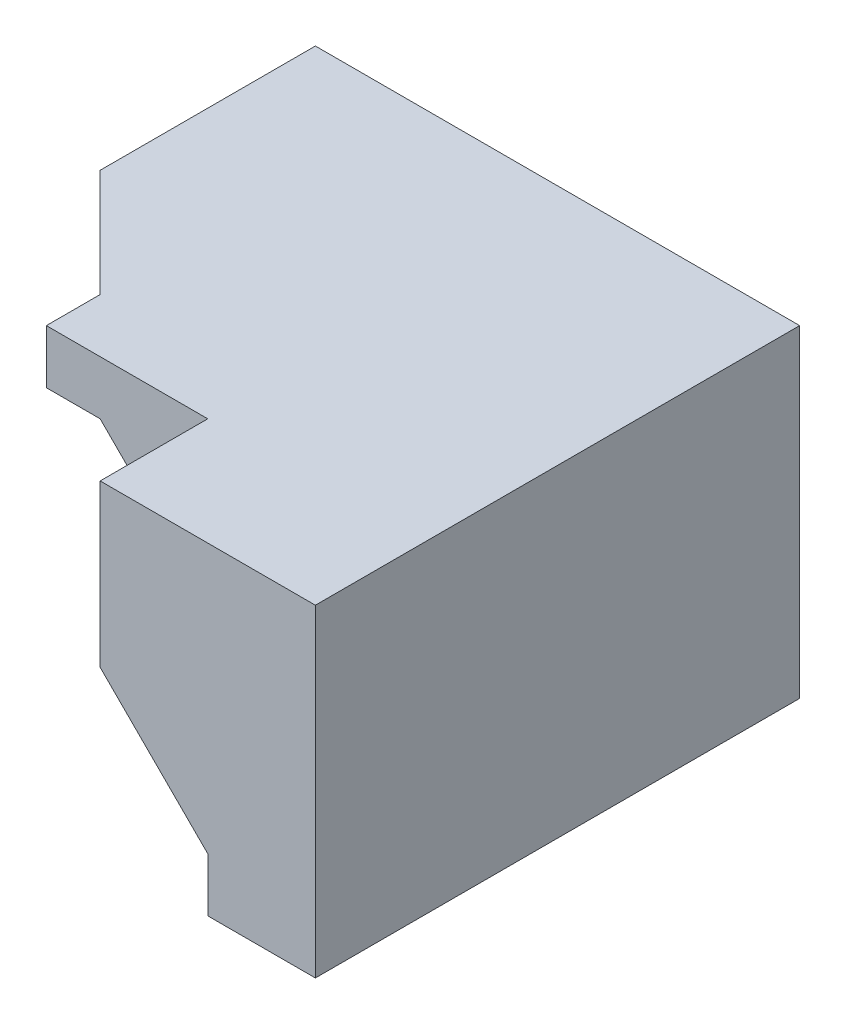
ISO-10303-21;
HEADER;
FILE_DESCRIPTION(('STEP AP214'),'2;1');
FILE_NAME('part.step','',(''),(''),'','','');
FILE_SCHEMA(('AUTOMOTIVE_DESIGN { 1 0 10303 214 1 1 1 1 }'));
ENDSEC;
DATA;
#1=APPLICATION_CONTEXT('core data for automotive mechanical design processes');
#2=APPLICATION_PROTOCOL_DEFINITION('international standard','automotive_design',2000,#1);
#3=PRODUCT_CONTEXT('',#1,'mechanical');
#4=PRODUCT('Part','Part','',(#3));
#5=PRODUCT_RELATED_PRODUCT_CATEGORY('part','',(#4));
#6=PRODUCT_DEFINITION_FORMATION('','',#4);
#7=PRODUCT_DEFINITION_CONTEXT('part definition',#1,'design');
#8=PRODUCT_DEFINITION('design','',#6,#7);
#9=PRODUCT_DEFINITION_SHAPE('','',#8);
#10=(LENGTH_UNIT() NAMED_UNIT(*) SI_UNIT(.MILLI.,.METRE.));
#11=(NAMED_UNIT(*) PLANE_ANGLE_UNIT() SI_UNIT($,.RADIAN.));
#12=(NAMED_UNIT(*) SI_UNIT($,.STERADIAN.) SOLID_ANGLE_UNIT());
#13=UNCERTAINTY_MEASURE_WITH_UNIT(LENGTH_MEASURE(1.E-05),#10,'distance_accuracy_value','');
#14=(GEOMETRIC_REPRESENTATION_CONTEXT(3) GLOBAL_UNCERTAINTY_ASSIGNED_CONTEXT((#13)) GLOBAL_UNIT_ASSIGNED_CONTEXT((#10,
#11,#12)) REPRESENTATION_CONTEXT('',''));
#15=CARTESIAN_POINT('',(0.,0.,0.));
#16=DIRECTION('',(0.,0.,1.));
#17=DIRECTION('',(1.,0.,0.));
#18=AXIS2_PLACEMENT_3D('',#15,#16,#17);
#19=CARTESIAN_POINT('',(20.,-20.,90.));
#20=DIRECTION('',(0.707106781186547,0.707106781186547,0.));
#21=DIRECTION('',(-0.707106781186548,0.707106781186547,0.));
#22=AXIS2_PLACEMENT_3D('',#19,#20,#21);
#23=PLANE('',#22);
#24=DIRECTION('',(0.,0.,1.));
#25=VECTOR('',#24,1.);
#26=CARTESIAN_POINT('',(-20.,20.,0.));
#27=LINE('',#26,#25);
#28=CARTESIAN_POINT('',(-20.,20.,40.));
#29=VERTEX_POINT('',#28);
#30=CARTESIAN_POINT('',(-20.,20.,70.));
#31=VERTEX_POINT('',#30);
#32=EDGE_CURVE('E252',#29,#31,#27,.T.);
#33=ORIENTED_EDGE('',*,*,#32,.F.);
#34=DIRECTION('',(0.707106781186548,-0.707106781186548,0.));
#35=VECTOR('',#34,1.);
#36=CARTESIAN_POINT('',(0.,0.,40.));
#37=LINE('',#36,#35);
#38=CARTESIAN_POINT('',(10.,-9.99999999999999,40.));
#39=VERTEX_POINT('',#38);
#40=EDGE_CURVE('E51',#29,#39,#37,.T.);
#41=ORIENTED_EDGE('',*,*,#40,.T.);
#42=DIRECTION('',(0.408248290463863,-0.408248290463863,0.816496580927726));
#43=VECTOR('',#42,1.);
#44=CARTESIAN_POINT('',(30.,-30.,80.));
#45=LINE('',#44,#43);
#46=CARTESIAN_POINT('',(20.,-20.,60.));
#47=VERTEX_POINT('',#46);
#48=EDGE_CURVE('E55',#39,#47,#45,.T.);
#49=ORIENTED_EDGE('',*,*,#48,.T.);
#50=DIRECTION('',(0.,0.,-1.));
#51=VECTOR('',#50,1.);
#52=CARTESIAN_POINT('',(20.,-20.,90.));
#53=LINE('',#52,#51);
#54=CARTESIAN_POINT('',(20.,-20.,90.));
#55=VERTEX_POINT('',#54);
#56=EDGE_CURVE('E11',#55,#47,#53,.T.);
#57=ORIENTED_EDGE('',*,*,#56,.F.);
#58=DIRECTION('',(0.707106781186548,-0.707106781186548,0.));
#59=VECTOR('',#58,1.);
#60=CARTESIAN_POINT('',(20.,-20.,90.));
#61=LINE('',#60,#59);
#62=CARTESIAN_POINT('',(0.,0.,90.));
#63=VERTEX_POINT('',#62);
#64=EDGE_CURVE('E261',#63,#55,#61,.T.);
#65=ORIENTED_EDGE('',*,*,#64,.F.);
#66=DIRECTION('',(0.,0.,-1.));
#67=VECTOR('',#66,1.);
#68=CARTESIAN_POINT('',(0.,0.,90.));
#69=LINE('',#68,#67);
#70=CARTESIAN_POINT('',(0.,0.,70.));
#71=VERTEX_POINT('',#70);
#72=EDGE_CURVE('E275',#63,#71,#69,.T.);
#73=ORIENTED_EDGE('',*,*,#72,.T.);
#74=DIRECTION('',(0.707106781186548,-0.707106781186547,0.));
#75=VECTOR('',#74,1.);
#76=CARTESIAN_POINT('',(-20.,20.,70.));
#77=LINE('',#76,#75);
#78=EDGE_CURVE('E301',#31,#71,#77,.T.);
#79=ORIENTED_EDGE('',*,*,#78,.F.);
#80=EDGE_LOOP('',(#33,#41,#49,#57,#65,#73,#79));
#81=FACE_BOUND('',#80,.T.);
#82=ADVANCED_FACE('F35',(#81),#23,.F.);
#83=CARTESIAN_POINT('',(0.,10.,0.));
#84=DIRECTION('',(0.,-1.,0.));
#85=DIRECTION('',(0.,0.,-1.));
#86=AXIS2_PLACEMENT_3D('',#83,#84,#85);
#87=PLANE('',#86);
#88=DIRECTION('',(0.,0.,-1.));
#89=VECTOR('',#88,1.);
#90=CARTESIAN_POINT('',(-40.,10.,0.));
#91=LINE('',#90,#89);
#92=CARTESIAN_POINT('',(-40.,10.,30.0000000000001));
#93=VERTEX_POINT('',#92);
#94=CARTESIAN_POINT('',(-40.,10.,0.));
#95=VERTEX_POINT('',#94);
#96=EDGE_CURVE('E197',#93,#95,#91,.T.);
#97=ORIENTED_EDGE('',*,*,#96,.F.);
#98=DIRECTION('',(-1.,0.,0.));
#99=VECTOR('',#98,1.);
#100=CARTESIAN_POINT('',(-30.,10.,30.));
#101=LINE('',#100,#99);
#102=CARTESIAN_POINT('',(-50.,10.,30.));
#103=VERTEX_POINT('',#102);
#104=EDGE_CURVE('E217',#93,#103,#101,.T.);
#105=ORIENTED_EDGE('',*,*,#104,.T.);
#106=DIRECTION('',(0.,0.,1.));
#107=VECTOR('',#106,1.);
#108=CARTESIAN_POINT('',(-50.,10.,40.));
#109=LINE('',#108,#107);
#110=CARTESIAN_POINT('',(-50.,10.,0.));
#111=VERTEX_POINT('',#110);
#112=EDGE_CURVE('E220',#111,#103,#109,.T.);
#113=ORIENTED_EDGE('',*,*,#112,.F.);
#114=DIRECTION('',(-1.,0.,0.));
#115=VECTOR('',#114,1.);
#116=CARTESIAN_POINT('',(-40.,10.,0.));
#117=LINE('',#116,#115);
#118=EDGE_CURVE('E205',#95,#111,#117,.T.);
#119=ORIENTED_EDGE('',*,*,#118,.F.);
#120=EDGE_LOOP('',(#97,#105,#113,#119));
#121=FACE_BOUND('',#120,.T.);
#122=ADVANCED_FACE('F361',(#121),#87,.T.);
#123=CARTESIAN_POINT('',(0.,0.,90.));
#124=DIRECTION('',(1.,0.,0.));
#125=DIRECTION('',(0.,0.,-1.));
#126=AXIS2_PLACEMENT_3D('',#123,#124,#125);
#127=PLANE('',#126);
#128=DIRECTION('',(0.,1.,0.));
#129=VECTOR('',#128,1.);
#130=CARTESIAN_POINT('',(0.,0.,70.));
#131=LINE('',#130,#129);
#132=CARTESIAN_POINT('',(0.,30.,70.));
#133=VERTEX_POINT('',#132);
#134=EDGE_CURVE('E235',#71,#133,#131,.T.);
#135=ORIENTED_EDGE('',*,*,#134,.F.);
#136=ORIENTED_EDGE('',*,*,#72,.F.);
#137=DIRECTION('',(0.,-1.,0.));
#138=VECTOR('',#137,1.);
#139=CARTESIAN_POINT('',(0.,0.,90.));
#140=LINE('',#139,#138);
#141=CARTESIAN_POINT('',(0.,30.,90.));
#142=VERTEX_POINT('',#141);
#143=EDGE_CURVE('E273',#142,#63,#140,.T.);
#144=ORIENTED_EDGE('',*,*,#143,.F.);
#145=DIRECTION('',(0.,0.,-1.));
#146=VECTOR('',#145,1.);
#147=CARTESIAN_POINT('',(0.,30.,90.));
#148=LINE('',#147,#146);
#149=EDGE_CURVE('E289',#142,#133,#148,.T.);
#150=ORIENTED_EDGE('',*,*,#149,.T.);
#151=EDGE_LOOP('',(#135,#136,#144,#150));
#152=FACE_BOUND('',#151,.T.);
#153=ADVANCED_FACE('F322',(#152),#127,.F.);
#154=CARTESIAN_POINT('',(20.,-30.,90.));
#155=DIRECTION('',(1.,0.,0.));
#156=DIRECTION('',(0.,0.,-1.));
#157=AXIS2_PLACEMENT_3D('',#154,#155,#156);
#158=PLANE('',#157);
#159=ORIENTED_EDGE('',*,*,#56,.T.);
#160=DIRECTION('',(0.,-1.,0.));
#161=VECTOR('',#160,1.);
#162=CARTESIAN_POINT('',(20.,0.,60.));
#163=LINE('',#162,#161);
#164=CARTESIAN_POINT('',(20.,-30.,60.));
#165=VERTEX_POINT('',#164);
#166=EDGE_CURVE('E188',#47,#165,#163,.T.);
#167=ORIENTED_EDGE('',*,*,#166,.T.);
#168=DIRECTION('',(0.,0.,-1.));
#169=VECTOR('',#168,1.);
#170=CARTESIAN_POINT('',(20.,-30.,90.));
#171=LINE('',#170,#169);
#172=CARTESIAN_POINT('',(20.,-30.,90.));
#173=VERTEX_POINT('',#172);
#174=EDGE_CURVE('E43',#173,#165,#171,.T.);
#175=ORIENTED_EDGE('',*,*,#174,.F.);
#176=DIRECTION('',(0.,-1.,0.));
#177=VECTOR('',#176,1.);
#178=CARTESIAN_POINT('',(20.,-30.,90.));
#179=LINE('',#178,#177);
#180=EDGE_CURVE('E264',#55,#173,#179,.T.);
#181=ORIENTED_EDGE('',*,*,#180,.F.);
#182=EDGE_LOOP('',(#159,#167,#175,#181));
#183=FACE_BOUND('',#182,.T.);
#184=ADVANCED_FACE('F370',(#183),#158,.F.);
#185=CARTESIAN_POINT('',(40.,-30.,90.));
#186=DIRECTION('',(0.,1.,0.));
#187=DIRECTION('',(-1.,0.,0.));
#188=AXIS2_PLACEMENT_3D('',#185,#186,#187);
#189=PLANE('',#188);
#190=DIRECTION('',(1.,0.,0.));
#191=VECTOR('',#190,1.);
#192=CARTESIAN_POINT('',(40.,-30.,0.));
#193=LINE('',#192,#191);
#194=CARTESIAN_POINT('',(10.,-30.,0.));
#195=VERTEX_POINT('',#194);
#196=CARTESIAN_POINT('',(40.,-30.,0.));
#197=VERTEX_POINT('',#196);
#198=EDGE_CURVE('E276',#195,#197,#193,.T.);
#199=ORIENTED_EDGE('',*,*,#198,.T.);
#200=DIRECTION('',(0.,0.,-1.));
#201=VECTOR('',#200,1.);
#202=CARTESIAN_POINT('',(40.,-30.,90.));
#203=LINE('',#202,#201);
#204=CARTESIAN_POINT('',(40.,-30.,90.));
#205=VERTEX_POINT('',#204);
#206=EDGE_CURVE('E335',#205,#197,#203,.T.);
#207=ORIENTED_EDGE('',*,*,#206,.F.);
#208=DIRECTION('',(1.,0.,0.));
#209=VECTOR('',#208,1.);
#210=CARTESIAN_POINT('',(40.,-30.,90.));
#211=LINE('',#210,#209);
#212=EDGE_CURVE('E267',#173,#205,#211,.T.);
#213=ORIENTED_EDGE('',*,*,#212,.F.);
#214=ORIENTED_EDGE('',*,*,#174,.T.);
#215=DIRECTION('',(-0.447213595499958,0.,-0.894427190999916));
#216=VECTOR('',#215,1.);
#217=CARTESIAN_POINT('',(10.,-30.,40.));
#218=LINE('',#217,#216);
#219=CARTESIAN_POINT('',(10.,-30.,40.));
#220=VERTEX_POINT('',#219);
#221=EDGE_CURVE('E183',#165,#220,#218,.T.);
#222=ORIENTED_EDGE('',*,*,#221,.T.);
#223=DIRECTION('',(0.,0.,-1.));
#224=VECTOR('',#223,1.);
#225=CARTESIAN_POINT('',(10.,-30.,0.));
#226=LINE('',#225,#224);
#227=EDGE_CURVE('E176',#220,#195,#226,.T.);
#228=ORIENTED_EDGE('',*,*,#227,.T.);
#229=EDGE_LOOP('',(#199,#207,#213,#214,#222,#228));
#230=FACE_BOUND('',#229,.T.);
#231=ADVANCED_FACE('F536',(#230),#189,.F.);
#232=CARTESIAN_POINT('',(40.,30.,90.));
#233=DIRECTION('',(-1.,0.,0.));
#234=DIRECTION('',(0.,-1.,0.));
#235=AXIS2_PLACEMENT_3D('',#232,#233,#234);
#236=PLANE('',#235);
#237=DIRECTION('',(0.,1.,0.));
#238=VECTOR('',#237,1.);
#239=CARTESIAN_POINT('',(40.,30.,0.));
#240=LINE('',#239,#238);
#241=CARTESIAN_POINT('',(40.,30.,0.));
#242=VERTEX_POINT('',#241);
#243=EDGE_CURVE('E278',#197,#242,#240,.T.);
#244=ORIENTED_EDGE('',*,*,#243,.T.);
#245=DIRECTION('',(0.,0.,-1.));
#246=VECTOR('',#245,1.);
#247=CARTESIAN_POINT('',(40.,30.,90.));
#248=LINE('',#247,#246);
#249=CARTESIAN_POINT('',(40.,30.,90.));
#250=VERTEX_POINT('',#249);
#251=EDGE_CURVE('E292',#250,#242,#248,.T.);
#252=ORIENTED_EDGE('',*,*,#251,.F.);
#253=DIRECTION('',(0.,1.,0.));
#254=VECTOR('',#253,1.);
#255=CARTESIAN_POINT('',(40.,30.,90.));
#256=LINE('',#255,#254);
#257=EDGE_CURVE('E269',#205,#250,#256,.T.);
#258=ORIENTED_EDGE('',*,*,#257,.F.);
#259=ORIENTED_EDGE('',*,*,#206,.T.);
#260=EDGE_LOOP('',(#244,#252,#258,#259));
#261=FACE_BOUND('',#260,.T.);
#262=ADVANCED_FACE('F487',(#261),#236,.F.);
#263=CARTESIAN_POINT('',(0.,30.,90.));
#264=DIRECTION('',(0.,-1.,0.));
#265=DIRECTION('',(0.,0.,-1.));
#266=AXIS2_PLACEMENT_3D('',#263,#264,#265);
#267=PLANE('',#266);
#268=DIRECTION('',(-1.,0.,0.));
#269=VECTOR('',#268,1.);
#270=CARTESIAN_POINT('',(0.,30.,0.));
#271=LINE('',#270,#269);
#272=CARTESIAN_POINT('',(-50.,30.,0.));
#273=VERTEX_POINT('',#272);
#274=EDGE_CURVE('E265',#242,#273,#271,.T.);
#275=ORIENTED_EDGE('',*,*,#274,.T.);
#276=DIRECTION('',(0.,0.,1.));
#277=VECTOR('',#276,1.);
#278=CARTESIAN_POINT('',(-50.,30.,40.));
#279=LINE('',#278,#277);
#280=CARTESIAN_POINT('',(-50.,30.,40.));
#281=VERTEX_POINT('',#280);
#282=EDGE_CURVE('E219',#273,#281,#279,.T.);
#283=ORIENTED_EDGE('',*,*,#282,.T.);
#284=DIRECTION('',(0.707106781186548,0.,0.707106781186547));
#285=VECTOR('',#284,1.);
#286=CARTESIAN_POINT('',(-30.,30.,60.));
#287=LINE('',#286,#285);
#288=CARTESIAN_POINT('',(-30.,30.,60.));
#289=VERTEX_POINT('',#288);
#290=EDGE_CURVE('E226',#281,#289,#287,.T.);
#291=ORIENTED_EDGE('',*,*,#290,.T.);
#292=DIRECTION('',(0.,0.,1.));
#293=VECTOR('',#292,1.);
#294=CARTESIAN_POINT('',(-30.,30.,0.));
#295=LINE('',#294,#293);
#296=CARTESIAN_POINT('',(-30.,30.,70.));
#297=VERTEX_POINT('',#296);
#298=EDGE_CURVE('E253',#289,#297,#295,.T.);
#299=ORIENTED_EDGE('',*,*,#298,.T.);
#300=DIRECTION('',(-1.,0.,0.));
#301=VECTOR('',#300,1.);
#302=CARTESIAN_POINT('',(0.,30.,70.));
#303=LINE('',#302,#301);
#304=EDGE_CURVE('E293',#133,#297,#303,.T.);
#305=ORIENTED_EDGE('',*,*,#304,.F.);
#306=ORIENTED_EDGE('',*,*,#149,.F.);
#307=DIRECTION('',(-1.,0.,0.));
#308=VECTOR('',#307,1.);
#309=CARTESIAN_POINT('',(0.,30.,90.));
#310=LINE('',#309,#308);
#311=EDGE_CURVE('E271',#250,#142,#310,.T.);
#312=ORIENTED_EDGE('',*,*,#311,.F.);
#313=ORIENTED_EDGE('',*,*,#251,.T.);
#314=EDGE_LOOP('',(#275,#283,#291,#299,#305,#306,#312,#313));
#315=FACE_BOUND('',#314,.T.);
#316=ADVANCED_FACE('F313',(#315),#267,.F.);
#317=CARTESIAN_POINT('',(0.,0.,90.));
#318=DIRECTION('',(0.,0.,-1.));
#319=DIRECTION('',(-1.,0.,0.));
#320=AXIS2_PLACEMENT_3D('',#317,#318,#319);
#321=PLANE('',#320);
#322=ORIENTED_EDGE('',*,*,#64,.T.);
#323=ORIENTED_EDGE('',*,*,#180,.T.);
#324=ORIENTED_EDGE('',*,*,#212,.T.);
#325=ORIENTED_EDGE('',*,*,#257,.T.);
#326=ORIENTED_EDGE('',*,*,#311,.T.);
#327=ORIENTED_EDGE('',*,*,#143,.T.);
#328=EDGE_LOOP('',(#322,#323,#324,#325,#326,#327));
#329=FACE_BOUND('',#328,.T.);
#330=ADVANCED_FACE('F326',(#329),#321,.F.);
#331=CARTESIAN_POINT('',(0.,0.,0.));
#332=DIRECTION('',(0.,0.,-1.));
#333=DIRECTION('',(-1.,0.,0.));
#334=AXIS2_PLACEMENT_3D('',#331,#332,#333);
#335=PLANE('',#334);
#336=ORIENTED_EDGE('',*,*,#198,.F.);
#337=DIRECTION('',(-0.832050294337844,0.554700196225229,0.));
#338=VECTOR('',#337,1.);
#339=CARTESIAN_POINT('',(10.,-30.,0.));
#340=LINE('',#339,#338);
#341=CARTESIAN_POINT('',(-20.,-10.,0.));
#342=VERTEX_POINT('',#341);
#343=EDGE_CURVE('E178',#195,#342,#340,.T.);
#344=ORIENTED_EDGE('',*,*,#343,.T.);
#345=DIRECTION('',(0.,1.,0.));
#346=VECTOR('',#345,1.);
#347=CARTESIAN_POINT('',(-20.,0.,0.));
#348=LINE('',#347,#346);
#349=CARTESIAN_POINT('',(-20.,0.,0.));
#350=VERTEX_POINT('',#349);
#351=EDGE_CURVE('E160',#342,#350,#348,.T.);
#352=ORIENTED_EDGE('',*,*,#351,.T.);
#353=DIRECTION('',(1.,0.,0.));
#354=VECTOR('',#353,1.);
#355=CARTESIAN_POINT('',(-30.,0.,0.));
#356=LINE('',#355,#354);
#357=CARTESIAN_POINT('',(-40.,0.,0.));
#358=VERTEX_POINT('',#357);
#359=EDGE_CURVE('E211',#358,#350,#356,.T.);
#360=ORIENTED_EDGE('',*,*,#359,.F.);
#361=DIRECTION('',(0.,-1.,0.));
#362=VECTOR('',#361,1.);
#363=CARTESIAN_POINT('',(-40.,0.,0.));
#364=LINE('',#363,#362);
#365=EDGE_CURVE('E200',#95,#358,#364,.T.);
#366=ORIENTED_EDGE('',*,*,#365,.F.);
#367=ORIENTED_EDGE('',*,*,#118,.T.);
#368=DIRECTION('',(0.,1.,0.));
#369=VECTOR('',#368,1.);
#370=CARTESIAN_POINT('',(-50.,10.,0.));
#371=LINE('',#370,#369);
#372=EDGE_CURVE('E223',#111,#273,#371,.T.);
#373=ORIENTED_EDGE('',*,*,#372,.T.);
#374=ORIENTED_EDGE('',*,*,#274,.F.);
#375=ORIENTED_EDGE('',*,*,#243,.F.);
#376=EDGE_LOOP('',(#336,#344,#352,#360,#366,#367,#373,#374,#375));
#377=FACE_BOUND('',#376,.T.);
#378=ADVANCED_FACE('F339',(#377),#335,.T.);
#379=CARTESIAN_POINT('',(-30.,20.,0.));
#380=DIRECTION('',(0.,-1.,0.));
#381=DIRECTION('',(0.,0.,-1.));
#382=AXIS2_PLACEMENT_3D('',#379,#380,#381);
#383=PLANE('',#382);
#384=DIRECTION('',(-1.,0.,0.));
#385=VECTOR('',#384,1.);
#386=CARTESIAN_POINT('',(-50.,20.,40.));
#387=LINE('',#386,#385);
#388=CARTESIAN_POINT('',(-50.,20.,40.));
#389=VERTEX_POINT('',#388);
#390=EDGE_CURVE('E240',#29,#389,#387,.T.);
#391=ORIENTED_EDGE('',*,*,#390,.F.);
#392=ORIENTED_EDGE('',*,*,#32,.T.);
#393=DIRECTION('',(1.,0.,0.));
#394=VECTOR('',#393,1.);
#395=CARTESIAN_POINT('',(-30.,20.,70.));
#396=LINE('',#395,#394);
#397=CARTESIAN_POINT('',(-30.,20.,70.));
#398=VERTEX_POINT('',#397);
#399=EDGE_CURVE('E305',#398,#31,#396,.T.);
#400=ORIENTED_EDGE('',*,*,#399,.F.);
#401=DIRECTION('',(0.,0.,1.));
#402=VECTOR('',#401,1.);
#403=CARTESIAN_POINT('',(-30.,20.,0.));
#404=LINE('',#403,#402);
#405=CARTESIAN_POINT('',(-30.,20.,60.));
#406=VERTEX_POINT('',#405);
#407=EDGE_CURVE('E249',#406,#398,#404,.T.);
#408=ORIENTED_EDGE('',*,*,#407,.F.);
#409=DIRECTION('',(0.707106781186548,0.,0.707106781186547));
#410=VECTOR('',#409,1.);
#411=CARTESIAN_POINT('',(-30.,20.,60.));
#412=LINE('',#411,#410);
#413=EDGE_CURVE('E238',#389,#406,#412,.T.);
#414=ORIENTED_EDGE('',*,*,#413,.F.);
#415=EDGE_LOOP('',(#391,#392,#400,#408,#414));
#416=FACE_BOUND('',#415,.T.);
#417=ADVANCED_FACE('F350',(#416),#383,.T.);
#418=CARTESIAN_POINT('',(-30.,30.,0.));
#419=DIRECTION('',(-1.,0.,0.));
#420=DIRECTION('',(0.,-1.,0.));
#421=AXIS2_PLACEMENT_3D('',#418,#419,#420);
#422=PLANE('',#421);
#423=DIRECTION('',(0.,1.,0.));
#424=VECTOR('',#423,1.);
#425=CARTESIAN_POINT('',(-30.,20.,60.));
#426=LINE('',#425,#424);
#427=EDGE_CURVE('E232',#406,#289,#426,.T.);
#428=ORIENTED_EDGE('',*,*,#427,.F.);
#429=ORIENTED_EDGE('',*,*,#407,.T.);
#430=DIRECTION('',(0.,-1.,0.));
#431=VECTOR('',#430,1.);
#432=CARTESIAN_POINT('',(-30.,30.,70.));
#433=LINE('',#432,#431);
#434=EDGE_CURVE('E296',#297,#398,#433,.T.);
#435=ORIENTED_EDGE('',*,*,#434,.F.);
#436=ORIENTED_EDGE('',*,*,#298,.F.);
#437=EDGE_LOOP('',(#428,#429,#435,#436));
#438=FACE_BOUND('',#437,.T.);
#439=ADVANCED_FACE('F317',(#438),#422,.T.);
#440=CARTESIAN_POINT('',(0.,0.,70.));
#441=DIRECTION('',(0.,0.,1.));
#442=DIRECTION('',(1.,0.,0.));
#443=AXIS2_PLACEMENT_3D('',#440,#441,#442);
#444=PLANE('',#443);
#445=ORIENTED_EDGE('',*,*,#134,.T.);
#446=ORIENTED_EDGE('',*,*,#304,.T.);
#447=ORIENTED_EDGE('',*,*,#434,.T.);
#448=ORIENTED_EDGE('',*,*,#399,.T.);
#449=ORIENTED_EDGE('',*,*,#78,.T.);
#450=EDGE_LOOP('',(#445,#446,#447,#448,#449));
#451=FACE_BOUND('',#450,.T.);
#452=ADVANCED_FACE('F319',(#451),#444,.T.);
#453=CARTESIAN_POINT('',(-30.,20.,60.));
#454=DIRECTION('',(-0.707106781186547,0.,0.707106781186548));
#455=DIRECTION('',(0.707106781186548,0.,0.707106781186547));
#456=AXIS2_PLACEMENT_3D('',#453,#454,#455);
#457=PLANE('',#456);
#458=ORIENTED_EDGE('',*,*,#290,.F.);
#459=DIRECTION('',(0.,1.,0.));
#460=VECTOR('',#459,1.);
#461=CARTESIAN_POINT('',(-50.,20.,40.));
#462=LINE('',#461,#460);
#463=EDGE_CURVE('E229',#389,#281,#462,.T.);
#464=ORIENTED_EDGE('',*,*,#463,.F.);
#465=ORIENTED_EDGE('',*,*,#413,.T.);
#466=ORIENTED_EDGE('',*,*,#427,.T.);
#467=EDGE_LOOP('',(#458,#464,#465,#466));
#468=FACE_BOUND('',#467,.T.);
#469=ADVANCED_FACE('F348',(#468),#457,.T.);
#470=CARTESIAN_POINT('',(-50.,10.,40.));
#471=DIRECTION('',(-1.,0.,0.));
#472=DIRECTION('',(0.,0.,1.));
#473=AXIS2_PLACEMENT_3D('',#470,#471,#472);
#474=PLANE('',#473);
#475=ORIENTED_EDGE('',*,*,#112,.T.);
#476=DIRECTION('',(0.,-0.707106781186547,-0.707106781186548));
#477=VECTOR('',#476,1.);
#478=CARTESIAN_POINT('',(-50.,20.,40.));
#479=LINE('',#478,#477);
#480=EDGE_CURVE('E214',#389,#103,#479,.T.);
#481=ORIENTED_EDGE('',*,*,#480,.F.);
#482=ORIENTED_EDGE('',*,*,#463,.T.);
#483=ORIENTED_EDGE('',*,*,#282,.F.);
#484=ORIENTED_EDGE('',*,*,#372,.F.);
#485=EDGE_LOOP('',(#475,#481,#482,#483,#484));
#486=FACE_BOUND('',#485,.T.);
#487=ADVANCED_FACE('F343',(#486),#474,.T.);
#488=CARTESIAN_POINT('',(-30.,20.,40.));
#489=DIRECTION('',(0.,0.707106781186548,-0.707106781186547));
#490=DIRECTION('',(0.,0.707106781186547,0.707106781186548));
#491=AXIS2_PLACEMENT_3D('',#488,#489,#490);
#492=PLANE('',#491);
#493=ORIENTED_EDGE('',*,*,#104,.F.);
#494=DIRECTION('',(0.,-0.707106781186544,-0.707106781186551));
#495=VECTOR('',#494,1.);
#496=CARTESIAN_POINT('',(-40.,0.,20.));
#497=LINE('',#496,#495);
#498=CARTESIAN_POINT('',(-40.,0.,20.));
#499=VERTEX_POINT('',#498);
#500=EDGE_CURVE('E195',#93,#499,#497,.T.);
#501=ORIENTED_EDGE('',*,*,#500,.T.);
#502=DIRECTION('',(-1.,0.,0.));
#503=VECTOR('',#502,1.);
#504=CARTESIAN_POINT('',(-30.,0.,20.));
#505=LINE('',#504,#503);
#506=CARTESIAN_POINT('',(-20.,0.,20.));
#507=VERTEX_POINT('',#506);
#508=EDGE_CURVE('E208',#507,#499,#505,.T.);
#509=ORIENTED_EDGE('',*,*,#508,.F.);
#510=DIRECTION('',(0.,-0.707106781186548,-0.707106781186547));
#511=VECTOR('',#510,1.);
#512=CARTESIAN_POINT('',(-20.,0.,20.));
#513=LINE('',#512,#511);
#514=EDGE_CURVE('E193',#29,#507,#513,.T.);
#515=ORIENTED_EDGE('',*,*,#514,.F.);
#516=ORIENTED_EDGE('',*,*,#390,.T.);
#517=ORIENTED_EDGE('',*,*,#480,.T.);
#518=EDGE_LOOP('',(#493,#501,#509,#515,#516,#517));
#519=FACE_BOUND('',#518,.T.);
#520=ADVANCED_FACE('F374',(#519),#492,.F.);
#521=CARTESIAN_POINT('',(0.,0.,0.));
#522=DIRECTION('',(0.,-1.,0.));
#523=DIRECTION('',(0.,0.,-1.));
#524=AXIS2_PLACEMENT_3D('',#521,#522,#523);
#525=PLANE('',#524);
#526=DIRECTION('',(0.,0.,-1.));
#527=VECTOR('',#526,1.);
#528=CARTESIAN_POINT('',(-20.,0.,40.));
#529=LINE('',#528,#527);
#530=EDGE_CURVE('E165',#507,#350,#529,.T.);
#531=ORIENTED_EDGE('',*,*,#530,.F.);
#532=ORIENTED_EDGE('',*,*,#508,.T.);
#533=DIRECTION('',(0.,0.,1.));
#534=VECTOR('',#533,1.);
#535=CARTESIAN_POINT('',(-40.,0.,20.));
#536=LINE('',#535,#534);
#537=EDGE_CURVE('E202',#358,#499,#536,.T.);
#538=ORIENTED_EDGE('',*,*,#537,.F.);
#539=ORIENTED_EDGE('',*,*,#359,.T.);
#540=EDGE_LOOP('',(#531,#532,#538,#539));
#541=FACE_BOUND('',#540,.T.);
#542=ADVANCED_FACE('F402',(#541),#525,.T.);
#543=CARTESIAN_POINT('',(-40.,0.,0.));
#544=DIRECTION('',(1.,0.,0.));
#545=DIRECTION('',(0.,0.,-1.));
#546=AXIS2_PLACEMENT_3D('',#543,#544,#545);
#547=PLANE('',#546);
#548=ORIENTED_EDGE('',*,*,#96,.T.);
#549=ORIENTED_EDGE('',*,*,#365,.T.);
#550=ORIENTED_EDGE('',*,*,#537,.T.);
#551=ORIENTED_EDGE('',*,*,#500,.F.);
#552=EDGE_LOOP('',(#548,#549,#550,#551));
#553=FACE_BOUND('',#552,.T.);
#554=ADVANCED_FACE('F409',(#553),#547,.F.);
#555=CARTESIAN_POINT('',(-20.,0.,0.));
#556=DIRECTION('',(-1.,0.,0.));
#557=DIRECTION('',(0.,0.,1.));
#558=AXIS2_PLACEMENT_3D('',#555,#556,#557);
#559=PLANE('',#558);
#560=DIRECTION('',(0.,1.,0.));
#561=VECTOR('',#560,1.);
#562=CARTESIAN_POINT('',(-20.,0.,40.));
#563=LINE('',#562,#561);
#564=CARTESIAN_POINT('',(-20.,-10.,40.));
#565=VERTEX_POINT('',#564);
#566=EDGE_CURVE('E158',#565,#29,#563,.T.);
#567=ORIENTED_EDGE('',*,*,#566,.T.);
#568=ORIENTED_EDGE('',*,*,#514,.T.);
#569=ORIENTED_EDGE('',*,*,#530,.T.);
#570=ORIENTED_EDGE('',*,*,#351,.F.);
#571=DIRECTION('',(0.,0.,-1.));
#572=VECTOR('',#571,1.);
#573=CARTESIAN_POINT('',(-20.,-10.,40.));
#574=LINE('',#573,#572);
#575=EDGE_CURVE('E154',#565,#342,#574,.T.);
#576=ORIENTED_EDGE('',*,*,#575,.F.);
#577=EDGE_LOOP('',(#567,#568,#569,#570,#576));
#578=FACE_BOUND('',#577,.T.);
#579=ADVANCED_FACE('F156',(#578),#559,.T.);
#580=CARTESIAN_POINT('',(10.,0.,40.));
#581=DIRECTION('',(-0.894427190999916,0.,0.447213595499958));
#582=DIRECTION('',(0.447213595499958,0.,0.894427190999916));
#583=AXIS2_PLACEMENT_3D('',#580,#581,#582);
#584=PLANE('',#583);
#585=ORIENTED_EDGE('',*,*,#48,.F.);
#586=DIRECTION('',(0.,-1.,0.));
#587=VECTOR('',#586,1.);
#588=CARTESIAN_POINT('',(10.,0.,40.));
#589=LINE('',#588,#587);
#590=EDGE_CURVE('E189',#39,#220,#589,.T.);
#591=ORIENTED_EDGE('',*,*,#590,.T.);
#592=ORIENTED_EDGE('',*,*,#221,.F.);
#593=ORIENTED_EDGE('',*,*,#166,.F.);
#594=EDGE_LOOP('',(#585,#591,#592,#593));
#595=FACE_BOUND('',#594,.T.);
#596=ADVANCED_FACE('F423',(#595),#584,.T.);
#597=CARTESIAN_POINT('',(10.,-30.,40.));
#598=DIRECTION('',(-0.554700196225229,-0.832050294337844,0.));
#599=DIRECTION('',(0.832050294337844,-0.554700196225229,0.));
#600=AXIS2_PLACEMENT_3D('',#597,#598,#599);
#601=PLANE('',#600);
#602=ORIENTED_EDGE('',*,*,#343,.F.);
#603=ORIENTED_EDGE('',*,*,#227,.F.);
#604=DIRECTION('',(-0.832050294337844,0.554700196225229,0.));
#605=VECTOR('',#604,1.);
#606=CARTESIAN_POINT('',(10.,-30.,40.));
#607=LINE('',#606,#605);
#608=EDGE_CURVE('E171',#220,#565,#607,.T.);
#609=ORIENTED_EDGE('',*,*,#608,.T.);
#610=ORIENTED_EDGE('',*,*,#575,.T.);
#611=EDGE_LOOP('',(#602,#603,#609,#610));
#612=FACE_BOUND('',#611,.T.);
#613=ADVANCED_FACE('F175',(#612),#601,.T.);
#614=CARTESIAN_POINT('',(0.,0.,40.));
#615=DIRECTION('',(0.,0.,1.));
#616=DIRECTION('',(1.,0.,0.));
#617=AXIS2_PLACEMENT_3D('',#614,#615,#616);
#618=PLANE('',#617);
#619=ORIENTED_EDGE('',*,*,#590,.F.);
#620=ORIENTED_EDGE('',*,*,#40,.F.);
#621=ORIENTED_EDGE('',*,*,#566,.F.);
#622=ORIENTED_EDGE('',*,*,#608,.F.);
#623=EDGE_LOOP('',(#619,#620,#621,#622));
#624=FACE_BOUND('',#623,.T.);
#625=ADVANCED_FACE('F170',(#624),#618,.T.);
#626=CLOSED_SHELL('',(#82,#122,#153,#184,#231,#262,#316,#330,#378,#417,#439,#452,#469,#487,#520,
#542,#554,#579,#596,#613,#625));
#627=MANIFOLD_SOLID_BREP('B2',#626);
#628=ADVANCED_BREP_SHAPE_REPRESENTATION('',(#18,#627),#14);
#629=SHAPE_DEFINITION_REPRESENTATION(#9,#628);
ENDSEC;
END-ISO-10303-21;
